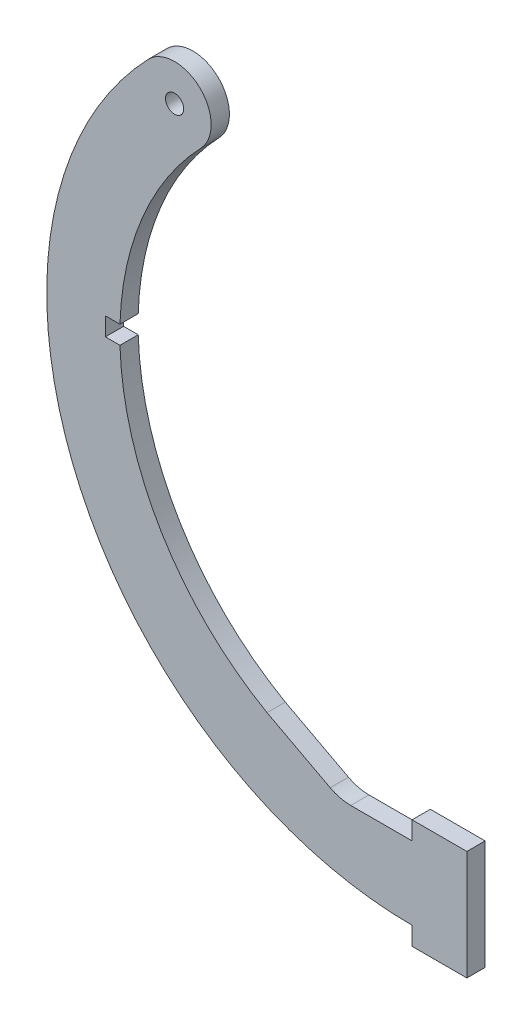
ISO-10303-21;
HEADER;
FILE_DESCRIPTION(('STEP AP214'),'2;1');
FILE_NAME('part.step','',(''),(''),'','','');
FILE_SCHEMA(('AUTOMOTIVE_DESIGN { 1 0 10303 214 1 1 1 1 }'));
ENDSEC;
DATA;
#1=APPLICATION_CONTEXT('core data for automotive mechanical design processes');
#2=APPLICATION_PROTOCOL_DEFINITION('international standard','automotive_design',2000,#1);
#3=PRODUCT_CONTEXT('',#1,'mechanical');
#4=PRODUCT('Part','Part','',(#3));
#5=PRODUCT_RELATED_PRODUCT_CATEGORY('part','',(#4));
#6=PRODUCT_DEFINITION_FORMATION('','',#4);
#7=PRODUCT_DEFINITION_CONTEXT('part definition',#1,'design');
#8=PRODUCT_DEFINITION('design','',#6,#7);
#9=PRODUCT_DEFINITION_SHAPE('','',#8);
#10=(LENGTH_UNIT() NAMED_UNIT(*) SI_UNIT(.MILLI.,.METRE.));
#11=(NAMED_UNIT(*) PLANE_ANGLE_UNIT() SI_UNIT($,.RADIAN.));
#12=(NAMED_UNIT(*) SI_UNIT($,.STERADIAN.) SOLID_ANGLE_UNIT());
#13=UNCERTAINTY_MEASURE_WITH_UNIT(LENGTH_MEASURE(1.E-05),#10,'distance_accuracy_value','');
#14=(GEOMETRIC_REPRESENTATION_CONTEXT(3) GLOBAL_UNCERTAINTY_ASSIGNED_CONTEXT((#13)) GLOBAL_UNIT_ASSIGNED_CONTEXT((#10,
#11,#12)) REPRESENTATION_CONTEXT('',''));
#15=CARTESIAN_POINT('',(0.,0.,0.));
#16=DIRECTION('',(0.,0.,1.));
#17=DIRECTION('',(1.,0.,0.));
#18=AXIS2_PLACEMENT_3D('',#15,#16,#17);
#19=CARTESIAN_POINT('',(145.943650406504,22.7725558069382,3.175));
#20=DIRECTION('',(0.,0.,1.));
#21=DIRECTION('',(1.,0.,0.));
#22=AXIS2_PLACEMENT_3D('',#19,#20,#21);
#23=PLANE('',#22);
#24=CARTESIAN_POINT('',(145.943650406504,22.7725558069382,3.175));
#25=DIRECTION('',(0.,0.,1.));
#26=DIRECTION('',(1.,0.,0.));
#27=AXIS2_PLACEMENT_3D('',#24,#25,#26);
#28=CIRCLE('',#27,63.5);
#29=CARTESIAN_POINT('',(100.082539295393,66.6930349442873,3.175));
#30=VERTEX_POINT('',#29);
#31=CARTESIAN_POINT('',(145.943650406504,-40.7274441930619,3.175));
#32=VERTEX_POINT('',#31);
#33=EDGE_CURVE('E208',#30,#32,#28,.T.);
#34=ORIENTED_EDGE('',*,*,#33,.T.);
#35=DIRECTION('',(0.,-1.,0.));
#36=VECTOR('',#35,1.);
#37=CARTESIAN_POINT('',(145.943650406504,-40.7274441930619,3.175));
#38=LINE('',#37,#36);
#39=CARTESIAN_POINT('',(145.943650406504,-43.9024441930618,3.175));
#40=VERTEX_POINT('',#39);
#41=EDGE_CURVE('E118',#32,#40,#38,.T.);
#42=ORIENTED_EDGE('',*,*,#41,.T.);
#43=DIRECTION('',(1.,0.,0.));
#44=VECTOR('',#43,1.);
#45=CARTESIAN_POINT('',(145.943650406504,-43.9024441930618,3.175));
#46=LINE('',#45,#44);
#47=CARTESIAN_POINT('',(155.468650406504,-43.9024441930619,3.175));
#48=VERTEX_POINT('',#47);
#49=EDGE_CURVE('E244',#40,#48,#46,.T.);
#50=ORIENTED_EDGE('',*,*,#49,.T.);
#51=DIRECTION('',(0.,1.,0.));
#52=VECTOR('',#51,1.);
#53=CARTESIAN_POINT('',(155.468650406504,-43.9024441930619,3.175));
#54=LINE('',#53,#52);
#55=CARTESIAN_POINT('',(155.468650406504,-24.8524441930618,3.175));
#56=VERTEX_POINT('',#55);
#57=EDGE_CURVE('E261',#48,#56,#54,.T.);
#58=ORIENTED_EDGE('',*,*,#57,.T.);
#59=DIRECTION('',(-1.,0.,0.));
#60=VECTOR('',#59,1.);
#61=CARTESIAN_POINT('',(152.293650406504,-24.8524441930618,3.175));
#62=LINE('',#61,#60);
#63=CARTESIAN_POINT('',(145.943650406504,-24.8524441930618,3.175));
#64=VERTEX_POINT('',#63);
#65=EDGE_CURVE('E258',#56,#64,#62,.T.);
#66=ORIENTED_EDGE('',*,*,#65,.T.);
#67=DIRECTION('',(0.,-1.,0.));
#68=VECTOR('',#67,1.);
#69=CARTESIAN_POINT('',(145.943650406504,-28.0274441930618,3.175));
#70=LINE('',#69,#68);
#71=CARTESIAN_POINT('',(145.943650406504,-28.0274441930618,3.175));
#72=VERTEX_POINT('',#71);
#73=EDGE_CURVE('E260',#64,#72,#70,.T.);
#74=ORIENTED_EDGE('',*,*,#73,.T.);
#75=DIRECTION('',(-1.,0.,0.));
#76=VECTOR('',#75,1.);
#77=CARTESIAN_POINT('',(145.943650406504,-28.0274441930618,3.175));
#78=LINE('',#77,#76);
#79=CARTESIAN_POINT('',(135.275650406504,-28.0274441930618,3.175));
#80=VERTEX_POINT('',#79);
#81=EDGE_CURVE('E263',#72,#80,#78,.T.);
#82=ORIENTED_EDGE('',*,*,#81,.T.);
#83=CARTESIAN_POINT('',(135.275650406504,-20.4074441930618,3.175));
#84=DIRECTION('',(0.,0.,-1.));
#85=DIRECTION('',(-1.,0.,0.));
#86=AXIS2_PLACEMENT_3D('',#83,#84,#85);
#87=CIRCLE('',#86,7.61999999999999);
#88=CARTESIAN_POINT('',(131.710241082646,-27.1418525823224,3.175));
#89=VERTEX_POINT('',#88);
#90=EDGE_CURVE('E269',#80,#89,#87,.T.);
#91=ORIENTED_EDGE('',*,*,#90,.T.);
#92=DIRECTION('',(-0.883780628511892,0.467901486070653,0.));
#93=VECTOR('',#92,1.);
#94=CARTESIAN_POINT('',(131.710241082646,-27.1418525823224,3.175));
#95=LINE('',#94,#93);
#96=CARTESIAN_POINT('',(120.729197753779,-21.3281400767266,3.175));
#97=VERTEX_POINT('',#96);
#98=EDGE_CURVE('E271',#89,#97,#95,.T.);
#99=ORIENTED_EDGE('',*,*,#98,.T.);
#100=CARTESIAN_POINT('',(145.943650406504,22.7725558069382,3.175));
#101=DIRECTION('',(0.,0.,-1.));
#102=DIRECTION('',(1.,0.,0.));
#103=AXIS2_PLACEMENT_3D('',#100,#101,#102);
#104=CIRCLE('',#103,50.8);
#105=CARTESIAN_POINT('',(95.1684611527948,21.1850558069382,3.175));
#106=VERTEX_POINT('',#105);
#107=EDGE_CURVE('E273',#97,#106,#104,.T.);
#108=ORIENTED_EDGE('',*,*,#107,.T.);
#109=DIRECTION('',(-1.,0.,0.));
#110=VECTOR('',#109,1.);
#111=CARTESIAN_POINT('',(92.6284611527948,21.1850558069382,3.175));
#112=LINE('',#111,#110);
#113=CARTESIAN_POINT('',(92.6284611527948,21.1850558069382,3.175));
#114=VERTEX_POINT('',#113);
#115=EDGE_CURVE('E275',#106,#114,#112,.T.);
#116=ORIENTED_EDGE('',*,*,#115,.T.);
#117=DIRECTION('',(0.,1.,0.));
#118=VECTOR('',#117,1.);
#119=CARTESIAN_POINT('',(92.6284611527948,24.3600558069381,3.175));
#120=LINE('',#119,#118);
#121=CARTESIAN_POINT('',(92.6284611527948,24.3600558069381,3.175));
#122=VERTEX_POINT('',#121);
#123=EDGE_CURVE('E158',#114,#122,#120,.T.);
#124=ORIENTED_EDGE('',*,*,#123,.T.);
#125=DIRECTION('',(1.,0.,0.));
#126=VECTOR('',#125,1.);
#127=CARTESIAN_POINT('',(95.1684611527948,24.3600558069382,3.175));
#128=LINE('',#127,#126);
#129=CARTESIAN_POINT('',(95.1684611527948,24.3600558069382,3.175));
#130=VERTEX_POINT('',#129);
#131=EDGE_CURVE('E152',#122,#130,#128,.T.);
#132=ORIENTED_EDGE('',*,*,#131,.T.);
#133=CARTESIAN_POINT('',(145.943650406504,22.7725558069382,3.175));
#134=DIRECTION('',(0.,0.,-1.));
#135=DIRECTION('',(1.,0.,0.));
#136=AXIS2_PLACEMENT_3D('',#133,#134,#135);
#137=CIRCLE('',#136,50.8);
#138=CARTESIAN_POINT('',(109.254761517615,57.9089391168175,3.175));
#139=VERTEX_POINT('',#138);
#140=EDGE_CURVE('E156',#130,#139,#137,.T.);
#141=ORIENTED_EDGE('',*,*,#140,.T.);
#142=CARTESIAN_POINT('',(104.668650406504,62.3009870305524,3.175));
#143=DIRECTION('',(0.,0.,1.));
#144=DIRECTION('',(1.,0.,0.));
#145=AXIS2_PLACEMENT_3D('',#142,#143,#144);
#146=CIRCLE('',#145,6.35);
#147=EDGE_CURVE('E54',#139,#30,#146,.T.);
#148=ORIENTED_EDGE('',*,*,#147,.T.);
#149=EDGE_LOOP('',(#34,#42,#50,#58,#66,#74,#82,#91,#99,#108,#116,#124,#132,#141,#148));
#150=FACE_BOUND('',#149,.T.);
#151=CARTESIAN_POINT('',(104.668650406504,62.3009870305524,3.175));
#152=DIRECTION('',(0.,0.,1.));
#153=DIRECTION('',(1.,0.,0.));
#154=AXIS2_PLACEMENT_3D('',#151,#152,#153);
#155=CIRCLE('',#154,1.58749999999998);
#156=CARTESIAN_POINT('',(106.256150406504,62.3009870305524,3.175));
#157=VERTEX_POINT('',#156);
#158=EDGE_CURVE('E180',#157,#157,#155,.T.);
#159=ORIENTED_EDGE('',*,*,#158,.F.);
#160=EDGE_LOOP('',(#159));
#161=FACE_BOUND('',#160,.T.);
#162=ADVANCED_FACE('F37',(#150,#161),#23,.T.);
#163=CARTESIAN_POINT('',(145.943650406504,22.7725558069382,0.));
#164=DIRECTION('',(0.,0.,1.));
#165=DIRECTION('',(1.,0.,0.));
#166=AXIS2_PLACEMENT_3D('',#163,#164,#165);
#167=PLANE('',#166);
#168=CARTESIAN_POINT('',(145.943650406504,22.7725558069382,0.));
#169=DIRECTION('',(0.,0.,1.));
#170=DIRECTION('',(1.,0.,0.));
#171=AXIS2_PLACEMENT_3D('',#168,#169,#170);
#172=CIRCLE('',#171,63.5);
#173=CARTESIAN_POINT('',(100.082539295393,66.6930349442873,0.));
#174=VERTEX_POINT('',#173);
#175=CARTESIAN_POINT('',(145.943650406504,-40.7274441930619,0.));
#176=VERTEX_POINT('',#175);
#177=EDGE_CURVE('E176',#174,#176,#172,.T.);
#178=ORIENTED_EDGE('',*,*,#177,.F.);
#179=CARTESIAN_POINT('',(104.668650406504,62.3009870305524,0.));
#180=DIRECTION('',(0.,0.,1.));
#181=DIRECTION('',(1.,0.,0.));
#182=AXIS2_PLACEMENT_3D('',#179,#180,#181);
#183=CIRCLE('',#182,6.35);
#184=CARTESIAN_POINT('',(109.254761517615,57.9089391168175,0.));
#185=VERTEX_POINT('',#184);
#186=EDGE_CURVE('E110',#185,#174,#183,.T.);
#187=ORIENTED_EDGE('',*,*,#186,.F.);
#188=CARTESIAN_POINT('',(145.943650406504,22.7725558069382,0.));
#189=DIRECTION('',(0.,0.,-1.));
#190=DIRECTION('',(1.,0.,0.));
#191=AXIS2_PLACEMENT_3D('',#188,#189,#190);
#192=CIRCLE('',#191,50.8);
#193=CARTESIAN_POINT('',(95.1684611527948,24.3600558069382,0.));
#194=VERTEX_POINT('',#193);
#195=EDGE_CURVE('E104',#194,#185,#192,.T.);
#196=ORIENTED_EDGE('',*,*,#195,.F.);
#197=DIRECTION('',(1.,0.,0.));
#198=VECTOR('',#197,1.);
#199=CARTESIAN_POINT('',(95.1684611527948,24.3600558069382,0.));
#200=LINE('',#199,#198);
#201=CARTESIAN_POINT('',(92.6284611527948,24.3600558069381,0.));
#202=VERTEX_POINT('',#201);
#203=EDGE_CURVE('E166',#202,#194,#200,.T.);
#204=ORIENTED_EDGE('',*,*,#203,.F.);
#205=DIRECTION('',(0.,1.,0.));
#206=VECTOR('',#205,1.);
#207=CARTESIAN_POINT('',(92.6284611527948,24.3600558069381,0.));
#208=LINE('',#207,#206);
#209=CARTESIAN_POINT('',(92.6284611527948,21.1850558069382,0.));
#210=VERTEX_POINT('',#209);
#211=EDGE_CURVE('E203',#210,#202,#208,.T.);
#212=ORIENTED_EDGE('',*,*,#211,.F.);
#213=DIRECTION('',(-1.,0.,0.));
#214=VECTOR('',#213,1.);
#215=CARTESIAN_POINT('',(92.6284611527948,21.1850558069382,0.));
#216=LINE('',#215,#214);
#217=CARTESIAN_POINT('',(95.1684611527948,21.1850558069382,0.));
#218=VERTEX_POINT('',#217);
#219=EDGE_CURVE('E201',#218,#210,#216,.T.);
#220=ORIENTED_EDGE('',*,*,#219,.F.);
#221=CARTESIAN_POINT('',(145.943650406504,22.7725558069382,0.));
#222=DIRECTION('',(0.,0.,-1.));
#223=DIRECTION('',(1.,0.,0.));
#224=AXIS2_PLACEMENT_3D('',#221,#222,#223);
#225=CIRCLE('',#224,50.8);
#226=CARTESIAN_POINT('',(120.729197753779,-21.3281400767266,0.));
#227=VERTEX_POINT('',#226);
#228=EDGE_CURVE('E199',#227,#218,#225,.T.);
#229=ORIENTED_EDGE('',*,*,#228,.F.);
#230=DIRECTION('',(-0.883780628511892,0.467901486070653,0.));
#231=VECTOR('',#230,1.);
#232=CARTESIAN_POINT('',(131.710241082646,-27.1418525823224,0.));
#233=LINE('',#232,#231);
#234=CARTESIAN_POINT('',(131.710241082646,-27.1418525823224,0.));
#235=VERTEX_POINT('',#234);
#236=EDGE_CURVE('E196',#235,#227,#233,.T.);
#237=ORIENTED_EDGE('',*,*,#236,.F.);
#238=CARTESIAN_POINT('',(135.275650406504,-20.4074441930618,0.));
#239=DIRECTION('',(0.,0.,-1.));
#240=DIRECTION('',(-1.,0.,0.));
#241=AXIS2_PLACEMENT_3D('',#238,#239,#240);
#242=CIRCLE('',#241,7.61999999999999);
#243=CARTESIAN_POINT('',(135.275650406504,-28.0274441930618,0.));
#244=VERTEX_POINT('',#243);
#245=EDGE_CURVE('E194',#244,#235,#242,.T.);
#246=ORIENTED_EDGE('',*,*,#245,.F.);
#247=DIRECTION('',(-1.,0.,0.));
#248=VECTOR('',#247,1.);
#249=CARTESIAN_POINT('',(145.943650406504,-28.0274441930618,0.));
#250=LINE('',#249,#248);
#251=CARTESIAN_POINT('',(145.943650406504,-28.0274441930618,0.));
#252=VERTEX_POINT('',#251);
#253=EDGE_CURVE('E192',#252,#244,#250,.T.);
#254=ORIENTED_EDGE('',*,*,#253,.F.);
#255=DIRECTION('',(0.,-1.,0.));
#256=VECTOR('',#255,1.);
#257=CARTESIAN_POINT('',(145.943650406504,-28.0274441930618,0.));
#258=LINE('',#257,#256);
#259=CARTESIAN_POINT('',(145.943650406504,-24.8524441930618,0.));
#260=VERTEX_POINT('',#259);
#261=EDGE_CURVE('E190',#260,#252,#258,.T.);
#262=ORIENTED_EDGE('',*,*,#261,.F.);
#263=DIRECTION('',(-1.,0.,0.));
#264=VECTOR('',#263,1.);
#265=CARTESIAN_POINT('',(145.943650406504,-24.8524441930618,0.));
#266=LINE('',#265,#264);
#267=CARTESIAN_POINT('',(155.468650406504,-24.8524441930618,0.));
#268=VERTEX_POINT('',#267);
#269=EDGE_CURVE('E188',#268,#260,#266,.T.);
#270=ORIENTED_EDGE('',*,*,#269,.F.);
#271=DIRECTION('',(0.,1.,0.));
#272=VECTOR('',#271,1.);
#273=CARTESIAN_POINT('',(155.468650406504,-24.8524441930618,0.));
#274=LINE('',#273,#272);
#275=CARTESIAN_POINT('',(155.468650406504,-43.9024441930619,0.));
#276=VERTEX_POINT('',#275);
#277=EDGE_CURVE('E185',#276,#268,#274,.T.);
#278=ORIENTED_EDGE('',*,*,#277,.F.);
#279=DIRECTION('',(1.,0.,0.));
#280=VECTOR('',#279,1.);
#281=CARTESIAN_POINT('',(145.943650406504,-43.9024441930618,0.));
#282=LINE('',#281,#280);
#283=CARTESIAN_POINT('',(145.943650406504,-43.9024441930618,0.));
#284=VERTEX_POINT('',#283);
#285=EDGE_CURVE('E182',#284,#276,#282,.T.);
#286=ORIENTED_EDGE('',*,*,#285,.F.);
#287=DIRECTION('',(0.,-1.,0.));
#288=VECTOR('',#287,1.);
#289=CARTESIAN_POINT('',(145.943650406504,-40.7274441930619,0.));
#290=LINE('',#289,#288);
#291=EDGE_CURVE('E179',#176,#284,#290,.T.);
#292=ORIENTED_EDGE('',*,*,#291,.F.);
#293=EDGE_LOOP('',(#178,#187,#196,#204,#212,#220,#229,#237,#246,#254,#262,#270,#278,#286,#292));
#294=FACE_BOUND('',#293,.T.);
#295=CARTESIAN_POINT('',(104.668650406504,62.3009870305524,0.));
#296=DIRECTION('',(0.,0.,1.));
#297=DIRECTION('',(1.,0.,0.));
#298=AXIS2_PLACEMENT_3D('',#295,#296,#297);
#299=CIRCLE('',#298,1.58749999999998);
#300=CARTESIAN_POINT('',(106.256150406504,62.3009870305524,0.));
#301=VERTEX_POINT('',#300);
#302=EDGE_CURVE('E472',#301,#301,#299,.T.);
#303=ORIENTED_EDGE('',*,*,#302,.T.);
#304=EDGE_LOOP('',(#303));
#305=FACE_BOUND('',#304,.T.);
#306=ADVANCED_FACE('F247',(#294,#305),#167,.F.);
#307=CARTESIAN_POINT('',(145.943650406504,22.7725558069382,3.175));
#308=DIRECTION('',(0.,0.,-1.));
#309=DIRECTION('',(-1.,0.,0.));
#310=AXIS2_PLACEMENT_3D('',#307,#308,#309);
#311=CYLINDRICAL_SURFACE('',#310,63.5);
#312=ORIENTED_EDGE('',*,*,#177,.T.);
#313=DIRECTION('',(0.,0.,-1.));
#314=VECTOR('',#313,1.);
#315=CARTESIAN_POINT('',(145.943650406504,-40.7274441930619,3.175));
#316=LINE('',#315,#314);
#317=EDGE_CURVE('E11',#32,#176,#316,.T.);
#318=ORIENTED_EDGE('',*,*,#317,.F.);
#319=ORIENTED_EDGE('',*,*,#33,.F.);
#320=DIRECTION('',(0.,0.,-1.));
#321=VECTOR('',#320,1.);
#322=CARTESIAN_POINT('',(100.082539295393,66.6930349442873,3.175));
#323=LINE('',#322,#321);
#324=EDGE_CURVE('E172',#30,#174,#323,.T.);
#325=ORIENTED_EDGE('',*,*,#324,.T.);
#326=EDGE_LOOP('',(#312,#318,#319,#325));
#327=FACE_BOUND('',#326,.T.);
#328=ADVANCED_FACE('F39',(#327),#311,.T.);
#329=CARTESIAN_POINT('',(145.943650406504,-40.7274441930619,3.175));
#330=DIRECTION('',(1.,0.,0.));
#331=DIRECTION('',(0.,0.,-1.));
#332=AXIS2_PLACEMENT_3D('',#329,#330,#331);
#333=PLANE('',#332);
#334=ORIENTED_EDGE('',*,*,#291,.T.);
#335=DIRECTION('',(0.,0.,-1.));
#336=VECTOR('',#335,1.);
#337=CARTESIAN_POINT('',(145.943650406504,-43.9024441930618,3.175));
#338=LINE('',#337,#336);
#339=EDGE_CURVE('E46',#40,#284,#338,.T.);
#340=ORIENTED_EDGE('',*,*,#339,.F.);
#341=ORIENTED_EDGE('',*,*,#41,.F.);
#342=ORIENTED_EDGE('',*,*,#317,.T.);
#343=EDGE_LOOP('',(#334,#340,#341,#342));
#344=FACE_BOUND('',#343,.T.);
#345=ADVANCED_FACE('F309',(#344),#333,.F.);
#346=CARTESIAN_POINT('',(145.943650406504,-43.9024441930618,3.175));
#347=DIRECTION('',(0.,1.,0.));
#348=DIRECTION('',(-1.,0.,0.));
#349=AXIS2_PLACEMENT_3D('',#346,#347,#348);
#350=PLANE('',#349);
#351=ORIENTED_EDGE('',*,*,#285,.T.);
#352=DIRECTION('',(0.,0.,-1.));
#353=VECTOR('',#352,1.);
#354=CARTESIAN_POINT('',(155.468650406504,-43.9024441930619,3.175));
#355=LINE('',#354,#353);
#356=EDGE_CURVE('E236',#48,#276,#355,.T.);
#357=ORIENTED_EDGE('',*,*,#356,.F.);
#358=ORIENTED_EDGE('',*,*,#49,.F.);
#359=ORIENTED_EDGE('',*,*,#339,.T.);
#360=EDGE_LOOP('',(#351,#357,#358,#359));
#361=FACE_BOUND('',#360,.T.);
#362=ADVANCED_FACE('F242',(#361),#350,.F.);
#363=CARTESIAN_POINT('',(155.468650406504,-24.8524441930618,3.175));
#364=DIRECTION('',(-1.,0.,0.));
#365=DIRECTION('',(0.,0.,1.));
#366=AXIS2_PLACEMENT_3D('',#363,#364,#365);
#367=PLANE('',#366);
#368=ORIENTED_EDGE('',*,*,#277,.T.);
#369=DIRECTION('',(0.,0.,-1.));
#370=VECTOR('',#369,1.);
#371=CARTESIAN_POINT('',(155.468650406504,-24.8524441930618,3.175));
#372=LINE('',#371,#370);
#373=EDGE_CURVE('E233',#56,#268,#372,.T.);
#374=ORIENTED_EDGE('',*,*,#373,.F.);
#375=ORIENTED_EDGE('',*,*,#57,.F.);
#376=ORIENTED_EDGE('',*,*,#356,.T.);
#377=EDGE_LOOP('',(#368,#374,#375,#376));
#378=FACE_BOUND('',#377,.T.);
#379=ADVANCED_FACE('F252',(#378),#367,.F.);
#380=CARTESIAN_POINT('',(145.943650406504,-24.8524441930618,3.175));
#381=DIRECTION('',(0.,-1.,0.));
#382=DIRECTION('',(0.,0.,-1.));
#383=AXIS2_PLACEMENT_3D('',#380,#381,#382);
#384=PLANE('',#383);
#385=ORIENTED_EDGE('',*,*,#269,.T.);
#386=DIRECTION('',(0.,0.,-1.));
#387=VECTOR('',#386,1.);
#388=CARTESIAN_POINT('',(145.943650406504,-24.8524441930618,3.175));
#389=LINE('',#388,#387);
#390=EDGE_CURVE('E230',#64,#260,#389,.T.);
#391=ORIENTED_EDGE('',*,*,#390,.F.);
#392=ORIENTED_EDGE('',*,*,#65,.F.);
#393=ORIENTED_EDGE('',*,*,#373,.T.);
#394=EDGE_LOOP('',(#385,#391,#392,#393));
#395=FACE_BOUND('',#394,.T.);
#396=ADVANCED_FACE('F256',(#395),#384,.F.);
#397=CARTESIAN_POINT('',(145.943650406504,-28.0274441930618,3.175));
#398=DIRECTION('',(1.,0.,0.));
#399=DIRECTION('',(0.,0.,-1.));
#400=AXIS2_PLACEMENT_3D('',#397,#398,#399);
#401=PLANE('',#400);
#402=ORIENTED_EDGE('',*,*,#261,.T.);
#403=DIRECTION('',(0.,0.,-1.));
#404=VECTOR('',#403,1.);
#405=CARTESIAN_POINT('',(145.943650406504,-28.0274441930618,3.175));
#406=LINE('',#405,#404);
#407=EDGE_CURVE('E227',#72,#252,#406,.T.);
#408=ORIENTED_EDGE('',*,*,#407,.F.);
#409=ORIENTED_EDGE('',*,*,#73,.F.);
#410=ORIENTED_EDGE('',*,*,#390,.T.);
#411=EDGE_LOOP('',(#402,#408,#409,#410));
#412=FACE_BOUND('',#411,.T.);
#413=ADVANCED_FACE('F322',(#412),#401,.F.);
#414=CARTESIAN_POINT('',(145.943650406504,-28.0274441930618,3.175));
#415=DIRECTION('',(0.,-1.,0.));
#416=DIRECTION('',(0.,0.,-1.));
#417=AXIS2_PLACEMENT_3D('',#414,#415,#416);
#418=PLANE('',#417);
#419=ORIENTED_EDGE('',*,*,#253,.T.);
#420=DIRECTION('',(0.,0.,-1.));
#421=VECTOR('',#420,1.);
#422=CARTESIAN_POINT('',(135.275650406504,-28.0274441930618,3.175));
#423=LINE('',#422,#421);
#424=EDGE_CURVE('E224',#80,#244,#423,.T.);
#425=ORIENTED_EDGE('',*,*,#424,.F.);
#426=ORIENTED_EDGE('',*,*,#81,.F.);
#427=ORIENTED_EDGE('',*,*,#407,.T.);
#428=EDGE_LOOP('',(#419,#425,#426,#427));
#429=FACE_BOUND('',#428,.T.);
#430=ADVANCED_FACE('F325',(#429),#418,.F.);
#431=CARTESIAN_POINT('',(135.275650406504,-20.4074441930618,3.175));
#432=DIRECTION('',(0.,0.,-1.));
#433=DIRECTION('',(-1.,0.,0.));
#434=AXIS2_PLACEMENT_3D('',#431,#432,#433);
#435=CYLINDRICAL_SURFACE('',#434,7.61999999999999);
#436=ORIENTED_EDGE('',*,*,#245,.T.);
#437=DIRECTION('',(0.,0.,-1.));
#438=VECTOR('',#437,1.);
#439=CARTESIAN_POINT('',(131.710241082646,-27.1418525823224,3.175));
#440=LINE('',#439,#438);
#441=EDGE_CURVE('E221',#89,#235,#440,.T.);
#442=ORIENTED_EDGE('',*,*,#441,.F.);
#443=ORIENTED_EDGE('',*,*,#90,.F.);
#444=ORIENTED_EDGE('',*,*,#424,.T.);
#445=EDGE_LOOP('',(#436,#442,#443,#444));
#446=FACE_BOUND('',#445,.T.);
#447=ADVANCED_FACE('F329',(#446),#435,.F.);
#448=CARTESIAN_POINT('',(131.710241082646,-27.1418525823224,3.175));
#449=DIRECTION('',(-0.467901486070653,-0.883780628511892,0.));
#450=DIRECTION('',(0.883780628511892,-0.467901486070653,0.));
#451=AXIS2_PLACEMENT_3D('',#448,#449,#450);
#452=PLANE('',#451);
#453=ORIENTED_EDGE('',*,*,#236,.T.);
#454=DIRECTION('',(0.,0.,-1.));
#455=VECTOR('',#454,1.);
#456=CARTESIAN_POINT('',(120.729197753779,-21.3281400767266,3.175));
#457=LINE('',#456,#455);
#458=EDGE_CURVE('E218',#97,#227,#457,.T.);
#459=ORIENTED_EDGE('',*,*,#458,.F.);
#460=ORIENTED_EDGE('',*,*,#98,.F.);
#461=ORIENTED_EDGE('',*,*,#441,.T.);
#462=EDGE_LOOP('',(#453,#459,#460,#461));
#463=FACE_BOUND('',#462,.T.);
#464=ADVANCED_FACE('F333',(#463),#452,.F.);
#465=CARTESIAN_POINT('',(145.943650406504,22.7725558069382,3.175));
#466=DIRECTION('',(0.,0.,-1.));
#467=DIRECTION('',(-1.,0.,0.));
#468=AXIS2_PLACEMENT_3D('',#465,#466,#467);
#469=CYLINDRICAL_SURFACE('',#468,50.8);
#470=ORIENTED_EDGE('',*,*,#228,.T.);
#471=DIRECTION('',(0.,0.,-1.));
#472=VECTOR('',#471,1.);
#473=CARTESIAN_POINT('',(95.1684611527948,21.1850558069382,3.175));
#474=LINE('',#473,#472);
#475=EDGE_CURVE('E215',#106,#218,#474,.T.);
#476=ORIENTED_EDGE('',*,*,#475,.F.);
#477=ORIENTED_EDGE('',*,*,#107,.F.);
#478=ORIENTED_EDGE('',*,*,#458,.T.);
#479=EDGE_LOOP('',(#470,#476,#477,#478));
#480=FACE_BOUND('',#479,.T.);
#481=ADVANCED_FACE('F337',(#480),#469,.F.);
#482=CARTESIAN_POINT('',(92.6284611527948,21.1850558069382,3.175));
#483=DIRECTION('',(0.,-1.,0.));
#484=DIRECTION('',(0.,0.,-1.));
#485=AXIS2_PLACEMENT_3D('',#482,#483,#484);
#486=PLANE('',#485);
#487=ORIENTED_EDGE('',*,*,#219,.T.);
#488=DIRECTION('',(0.,0.,-1.));
#489=VECTOR('',#488,1.);
#490=CARTESIAN_POINT('',(92.6284611527948,21.1850558069382,3.175));
#491=LINE('',#490,#489);
#492=EDGE_CURVE('E212',#114,#210,#491,.T.);
#493=ORIENTED_EDGE('',*,*,#492,.F.);
#494=ORIENTED_EDGE('',*,*,#115,.F.);
#495=ORIENTED_EDGE('',*,*,#475,.T.);
#496=EDGE_LOOP('',(#487,#493,#494,#495));
#497=FACE_BOUND('',#496,.T.);
#498=ADVANCED_FACE('F281',(#497),#486,.F.);
#499=CARTESIAN_POINT('',(92.6284611527948,24.3600558069381,3.175));
#500=DIRECTION('',(-1.,0.,0.));
#501=DIRECTION('',(0.,0.,1.));
#502=AXIS2_PLACEMENT_3D('',#499,#500,#501);
#503=PLANE('',#502);
#504=ORIENTED_EDGE('',*,*,#211,.T.);
#505=DIRECTION('',(0.,0.,-1.));
#506=VECTOR('',#505,1.);
#507=CARTESIAN_POINT('',(92.6284611527948,24.3600558069381,3.175));
#508=LINE('',#507,#506);
#509=EDGE_CURVE('E167',#122,#202,#508,.T.);
#510=ORIENTED_EDGE('',*,*,#509,.F.);
#511=ORIENTED_EDGE('',*,*,#123,.F.);
#512=ORIENTED_EDGE('',*,*,#492,.T.);
#513=EDGE_LOOP('',(#504,#510,#511,#512));
#514=FACE_BOUND('',#513,.T.);
#515=ADVANCED_FACE('F285',(#514),#503,.F.);
#516=CARTESIAN_POINT('',(95.1684611527948,24.3600558069382,3.175));
#517=DIRECTION('',(0.,1.,0.));
#518=DIRECTION('',(-1.,0.,0.));
#519=AXIS2_PLACEMENT_3D('',#516,#517,#518);
#520=PLANE('',#519);
#521=ORIENTED_EDGE('',*,*,#203,.T.);
#522=DIRECTION('',(0.,0.,-1.));
#523=VECTOR('',#522,1.);
#524=CARTESIAN_POINT('',(95.1684611527948,24.3600558069382,3.175));
#525=LINE('',#524,#523);
#526=EDGE_CURVE('E163',#130,#194,#525,.T.);
#527=ORIENTED_EDGE('',*,*,#526,.F.);
#528=ORIENTED_EDGE('',*,*,#131,.F.);
#529=ORIENTED_EDGE('',*,*,#509,.T.);
#530=EDGE_LOOP('',(#521,#527,#528,#529));
#531=FACE_BOUND('',#530,.T.);
#532=ADVANCED_FACE('F164',(#531),#520,.F.);
#533=CARTESIAN_POINT('',(145.943650406504,22.7725558069382,3.175));
#534=DIRECTION('',(0.,0.,-1.));
#535=DIRECTION('',(-1.,0.,0.));
#536=AXIS2_PLACEMENT_3D('',#533,#534,#535);
#537=CYLINDRICAL_SURFACE('',#536,50.8);
#538=ORIENTED_EDGE('',*,*,#195,.T.);
#539=DIRECTION('',(0.,0.,-1.));
#540=VECTOR('',#539,1.);
#541=CARTESIAN_POINT('',(109.254761517615,57.9089391168175,3.175));
#542=LINE('',#541,#540);
#543=EDGE_CURVE('E168',#139,#185,#542,.T.);
#544=ORIENTED_EDGE('',*,*,#543,.F.);
#545=ORIENTED_EDGE('',*,*,#140,.F.);
#546=ORIENTED_EDGE('',*,*,#526,.T.);
#547=EDGE_LOOP('',(#538,#544,#545,#546));
#548=FACE_BOUND('',#547,.T.);
#549=ADVANCED_FACE('F170',(#548),#537,.F.);
#550=CARTESIAN_POINT('',(104.668650406504,62.3009870305524,3.175));
#551=DIRECTION('',(0.,0.,-1.));
#552=DIRECTION('',(-1.,0.,0.));
#553=AXIS2_PLACEMENT_3D('',#550,#551,#552);
#554=CYLINDRICAL_SURFACE('',#553,6.35);
#555=ORIENTED_EDGE('',*,*,#186,.T.);
#556=ORIENTED_EDGE('',*,*,#324,.F.);
#557=ORIENTED_EDGE('',*,*,#147,.F.);
#558=ORIENTED_EDGE('',*,*,#543,.T.);
#559=EDGE_LOOP('',(#555,#556,#557,#558));
#560=FACE_BOUND('',#559,.T.);
#561=ADVANCED_FACE('F289',(#560),#554,.T.);
#562=CARTESIAN_POINT('',(104.668650406504,62.3009870305524,3.175));
#563=DIRECTION('',(0.,0.,-1.));
#564=DIRECTION('',(-1.,0.,0.));
#565=AXIS2_PLACEMENT_3D('',#562,#563,#564);
#566=CYLINDRICAL_SURFACE('',#565,1.58749999999998);
#567=ORIENTED_EDGE('',*,*,#158,.T.);
#568=EDGE_LOOP('',(#567));
#569=FACE_BOUND('',#568,.T.);
#570=ORIENTED_EDGE('',*,*,#302,.F.);
#571=EDGE_LOOP('',(#570));
#572=FACE_BOUND('',#571,.T.);
#573=ADVANCED_FACE('F291',(#569,#572),#566,.F.);
#574=CLOSED_SHELL('',(#162,#306,#328,#345,#362,#379,#396,#413,#430,#447,#464,#481,#498,#515,
#532,#549,#561,#573));
#575=MANIFOLD_SOLID_BREP('B2',#574);
#576=ADVANCED_BREP_SHAPE_REPRESENTATION('',(#18,#575),#14);
#577=SHAPE_DEFINITION_REPRESENTATION(#9,#576);
ENDSEC;
END-ISO-10303-21;
